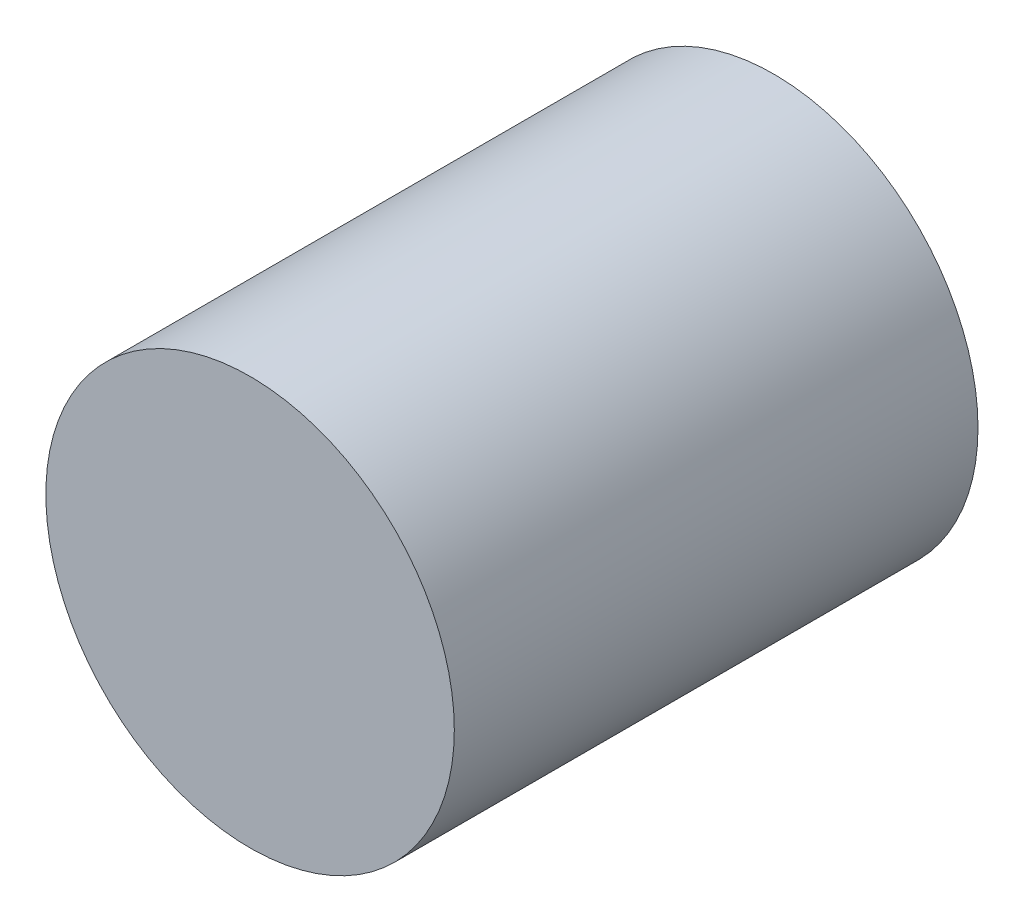
ISO-10303-21;
HEADER;
FILE_DESCRIPTION(('STEP AP214'),'2;1');
FILE_NAME('part.step','',(''),(''),'','','');
FILE_SCHEMA(('AUTOMOTIVE_DESIGN { 1 0 10303 214 1 1 1 1 }'));
ENDSEC;
DATA;
#1=APPLICATION_CONTEXT('core data for automotive mechanical design processes');
#2=APPLICATION_PROTOCOL_DEFINITION('international standard','automotive_design',2000,#1);
#3=PRODUCT_CONTEXT('',#1,'mechanical');
#4=PRODUCT('Part','Part','',(#3));
#5=PRODUCT_RELATED_PRODUCT_CATEGORY('part','',(#4));
#6=PRODUCT_DEFINITION_FORMATION('','',#4);
#7=PRODUCT_DEFINITION_CONTEXT('part definition',#1,'design');
#8=PRODUCT_DEFINITION('design','',#6,#7);
#9=PRODUCT_DEFINITION_SHAPE('','',#8);
#10=(LENGTH_UNIT() NAMED_UNIT(*) SI_UNIT(.MILLI.,.METRE.));
#11=(NAMED_UNIT(*) PLANE_ANGLE_UNIT() SI_UNIT($,.RADIAN.));
#12=(NAMED_UNIT(*) SI_UNIT($,.STERADIAN.) SOLID_ANGLE_UNIT());
#13=UNCERTAINTY_MEASURE_WITH_UNIT(LENGTH_MEASURE(1.E-05),#10,'distance_accuracy_value','');
#14=(GEOMETRIC_REPRESENTATION_CONTEXT(3) GLOBAL_UNCERTAINTY_ASSIGNED_CONTEXT((#13)) GLOBAL_UNIT_ASSIGNED_CONTEXT((#10,
#11,#12)) REPRESENTATION_CONTEXT('',''));
#15=CARTESIAN_POINT('',(0.,0.,0.));
#16=DIRECTION('',(0.,0.,1.));
#17=DIRECTION('',(1.,0.,0.));
#18=AXIS2_PLACEMENT_3D('',#15,#16,#17);
#19=CARTESIAN_POINT('',(0.,0.,25.4));
#20=DIRECTION('',(0.,0.,-1.));
#21=DIRECTION('',(-1.,0.,0.));
#22=AXIS2_PLACEMENT_3D('',#19,#20,#21);
#23=CYLINDRICAL_SURFACE('',#22,9.906);
#24=CARTESIAN_POINT('',(0.,0.,25.4));
#25=DIRECTION('',(0.,0.,1.));
#26=DIRECTION('',(1.,0.,0.));
#27=AXIS2_PLACEMENT_3D('',#24,#25,#26);
#28=CIRCLE('',#27,9.906);
#29=CARTESIAN_POINT('',(9.906,0.,25.4));
#30=VERTEX_POINT('',#29);
#31=EDGE_CURVE('E10',#30,#30,#28,.T.);
#32=ORIENTED_EDGE('',*,*,#31,.F.);
#33=EDGE_LOOP('',(#32));
#34=FACE_BOUND('',#33,.T.);
#35=CARTESIAN_POINT('',(0.,0.,0.));
#36=DIRECTION('',(0.,0.,1.));
#37=DIRECTION('',(1.,0.,0.));
#38=AXIS2_PLACEMENT_3D('',#35,#36,#37);
#39=CIRCLE('',#38,9.906);
#40=CARTESIAN_POINT('',(9.906,0.,0.));
#41=VERTEX_POINT('',#40);
#42=EDGE_CURVE('E33',#41,#41,#39,.T.);
#43=ORIENTED_EDGE('',*,*,#42,.T.);
#44=EDGE_LOOP('',(#43));
#45=FACE_BOUND('',#44,.T.);
#46=ADVANCED_FACE('F30',(#34,#45),#23,.T.);
#47=CARTESIAN_POINT('',(0.,0.,25.4));
#48=DIRECTION('',(0.,0.,1.));
#49=DIRECTION('',(1.,0.,0.));
#50=AXIS2_PLACEMENT_3D('',#47,#48,#49);
#51=PLANE('',#50);
#52=ORIENTED_EDGE('',*,*,#31,.T.);
#53=EDGE_LOOP('',(#52));
#54=FACE_BOUND('',#53,.T.);
#55=ADVANCED_FACE('F45',(#54),#51,.T.);
#56=CARTESIAN_POINT('',(0.,0.,0.));
#57=DIRECTION('',(0.,0.,1.));
#58=DIRECTION('',(1.,0.,0.));
#59=AXIS2_PLACEMENT_3D('',#56,#57,#58);
#60=PLANE('',#59);
#61=ORIENTED_EDGE('',*,*,#42,.F.);
#62=EDGE_LOOP('',(#61));
#63=FACE_BOUND('',#62,.T.);
#64=ADVANCED_FACE('F43',(#63),#60,.F.);
#65=CLOSED_SHELL('',(#46,#55,#64));
#66=MANIFOLD_SOLID_BREP('B2',#65);
#67=ADVANCED_BREP_SHAPE_REPRESENTATION('',(#18,#66),#14);
#68=SHAPE_DEFINITION_REPRESENTATION(#9,#67);
ENDSEC;
END-ISO-10303-21;
